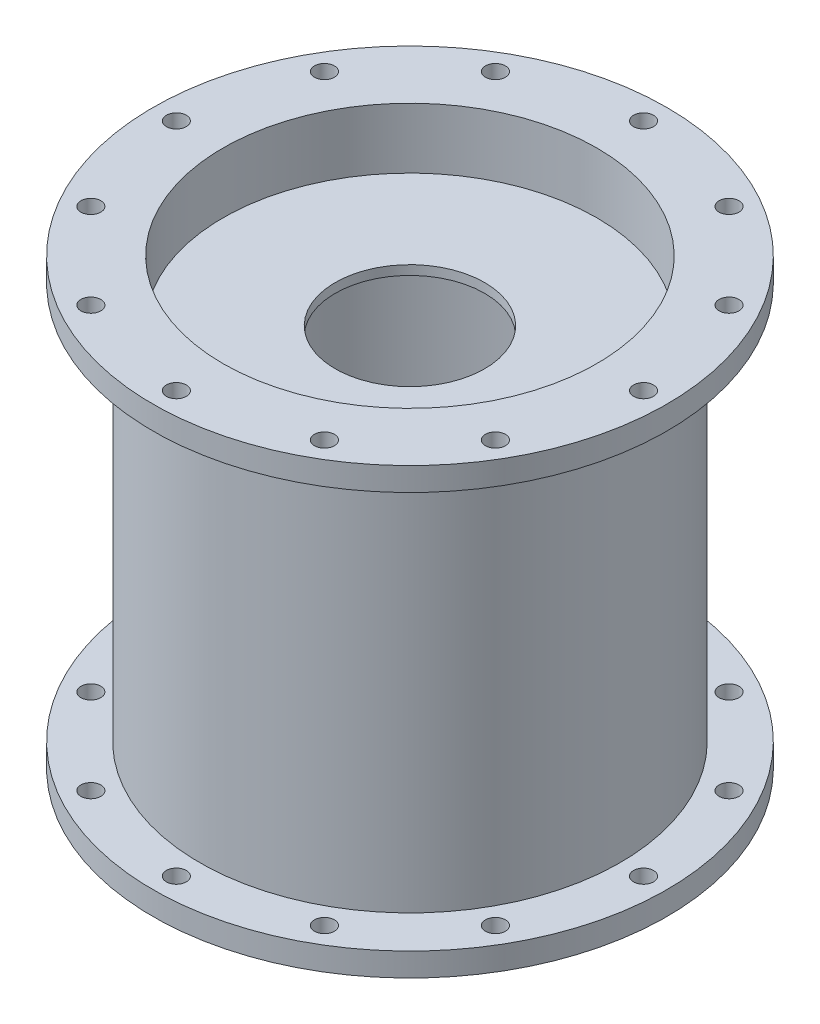
ISO-10303-21;
HEADER;
FILE_DESCRIPTION(('STEP AP214'),'2;1');
FILE_NAME('part.step','',(''),(''),'','','');
FILE_SCHEMA(('AUTOMOTIVE_DESIGN { 1 0 10303 214 1 1 1 1 }'));
ENDSEC;
DATA;
#1=APPLICATION_CONTEXT('core data for automotive mechanical design processes');
#2=APPLICATION_PROTOCOL_DEFINITION('international standard','automotive_design',2000,#1);
#3=PRODUCT_CONTEXT('',#1,'mechanical');
#4=PRODUCT('Part','Part','',(#3));
#5=PRODUCT_RELATED_PRODUCT_CATEGORY('part','',(#4));
#6=PRODUCT_DEFINITION_FORMATION('','',#4);
#7=PRODUCT_DEFINITION_CONTEXT('part definition',#1,'design');
#8=PRODUCT_DEFINITION('design','',#6,#7);
#9=PRODUCT_DEFINITION_SHAPE('','',#8);
#10=(LENGTH_UNIT() NAMED_UNIT(*) SI_UNIT(.MILLI.,.METRE.));
#11=(NAMED_UNIT(*) PLANE_ANGLE_UNIT() SI_UNIT($,.RADIAN.));
#12=(NAMED_UNIT(*) SI_UNIT($,.STERADIAN.) SOLID_ANGLE_UNIT());
#13=UNCERTAINTY_MEASURE_WITH_UNIT(LENGTH_MEASURE(1.E-05),#10,'distance_accuracy_value','');
#14=(GEOMETRIC_REPRESENTATION_CONTEXT(3) GLOBAL_UNCERTAINTY_ASSIGNED_CONTEXT((#13)) GLOBAL_UNIT_ASSIGNED_CONTEXT((#10,
#11,#12)) REPRESENTATION_CONTEXT('',''));
#15=CARTESIAN_POINT('',(0.,0.,0.));
#16=DIRECTION('',(0.,0.,1.));
#17=DIRECTION('',(1.,0.,0.));
#18=AXIS2_PLACEMENT_3D('',#15,#16,#17);
#19=CARTESIAN_POINT('',(0.,0.,-57.15));
#20=DIRECTION('',(0.,-1.,0.));
#21=DIRECTION('',(0.,0.,-1.));
#22=AXIS2_PLACEMENT_3D('',#19,#20,#21);
#23=PLANE('',#22);
#24=CARTESIAN_POINT('',(-54.9926131403119,0.,-31.75));
#25=DIRECTION('',(0.,1.,0.));
#26=DIRECTION('',(0.,0.,1.));
#27=AXIS2_PLACEMENT_3D('',#24,#25,#26);
#28=CIRCLE('',#27,2.70509999999997);
#29=CARTESIAN_POINT('',(-54.9926131403119,0.,-29.0449));
#30=VERTEX_POINT('',#29);
#31=EDGE_CURVE('E282',#30,#30,#28,.T.);
#32=ORIENTED_EDGE('',*,*,#31,.T.);
#33=EDGE_LOOP('',(#32));
#34=FACE_BOUND('',#33,.T.);
#35=CARTESIAN_POINT('',(-31.75,0.,-54.9926131403119));
#36=DIRECTION('',(0.,1.,0.));
#37=DIRECTION('',(0.,0.,1.));
#38=AXIS2_PLACEMENT_3D('',#35,#36,#37);
#39=CIRCLE('',#38,2.70509999999997);
#40=CARTESIAN_POINT('',(-31.75,0.,-52.2875131403119));
#41=VERTEX_POINT('',#40);
#42=EDGE_CURVE('E266',#41,#41,#39,.T.);
#43=ORIENTED_EDGE('',*,*,#42,.T.);
#44=EDGE_LOOP('',(#43));
#45=FACE_BOUND('',#44,.T.);
#46=CARTESIAN_POINT('',(31.75,0.,-54.9926131403119));
#47=DIRECTION('',(0.,1.,0.));
#48=DIRECTION('',(0.,0.,1.));
#49=AXIS2_PLACEMENT_3D('',#46,#47,#48);
#50=CIRCLE('',#49,2.70509999999997);
#51=CARTESIAN_POINT('',(31.75,0.,-52.2875131403119));
#52=VERTEX_POINT('',#51);
#53=EDGE_CURVE('E234',#52,#52,#50,.T.);
#54=ORIENTED_EDGE('',*,*,#53,.T.);
#55=EDGE_LOOP('',(#54));
#56=FACE_BOUND('',#55,.T.);
#57=CARTESIAN_POINT('',(54.9926131403118,0.,-31.75));
#58=DIRECTION('',(0.,1.,0.));
#59=DIRECTION('',(0.,0.,1.));
#60=AXIS2_PLACEMENT_3D('',#57,#58,#59);
#61=CIRCLE('',#60,2.70509999999997);
#62=CARTESIAN_POINT('',(54.9926131403118,0.,-29.0449));
#63=VERTEX_POINT('',#62);
#64=EDGE_CURVE('E218',#63,#63,#61,.T.);
#65=ORIENTED_EDGE('',*,*,#64,.T.);
#66=EDGE_LOOP('',(#65));
#67=FACE_BOUND('',#66,.T.);
#68=CARTESIAN_POINT('',(63.5,0.,0.));
#69=DIRECTION('',(0.,1.,0.));
#70=DIRECTION('',(0.,0.,1.));
#71=AXIS2_PLACEMENT_3D('',#68,#69,#70);
#72=CIRCLE('',#71,2.70509999999997);
#73=CARTESIAN_POINT('',(63.5,0.,2.70509999999998));
#74=VERTEX_POINT('',#73);
#75=EDGE_CURVE('E202',#74,#74,#72,.T.);
#76=ORIENTED_EDGE('',*,*,#75,.T.);
#77=EDGE_LOOP('',(#76));
#78=FACE_BOUND('',#77,.T.);
#79=CARTESIAN_POINT('',(54.9926131403119,0.,31.75));
#80=DIRECTION('',(0.,1.,0.));
#81=DIRECTION('',(0.,0.,1.));
#82=AXIS2_PLACEMENT_3D('',#79,#80,#81);
#83=CIRCLE('',#82,2.70509999999997);
#84=CARTESIAN_POINT('',(54.9926131403119,0.,34.4551));
#85=VERTEX_POINT('',#84);
#86=EDGE_CURVE('E186',#85,#85,#83,.T.);
#87=ORIENTED_EDGE('',*,*,#86,.T.);
#88=EDGE_LOOP('',(#87));
#89=FACE_BOUND('',#88,.T.);
#90=CARTESIAN_POINT('',(31.75,0.,54.9926131403118));
#91=DIRECTION('',(0.,1.,0.));
#92=DIRECTION('',(0.,0.,1.));
#93=AXIS2_PLACEMENT_3D('',#90,#91,#92);
#94=CIRCLE('',#93,2.70509999999997);
#95=CARTESIAN_POINT('',(31.75,0.,57.6977131403118));
#96=VERTEX_POINT('',#95);
#97=EDGE_CURVE('E170',#96,#96,#94,.T.);
#98=ORIENTED_EDGE('',*,*,#97,.T.);
#99=EDGE_LOOP('',(#98));
#100=FACE_BOUND('',#99,.T.);
#101=CARTESIAN_POINT('',(0.,0.,63.5));
#102=DIRECTION('',(0.,1.,0.));
#103=DIRECTION('',(0.,0.,1.));
#104=AXIS2_PLACEMENT_3D('',#101,#102,#103);
#105=CIRCLE('',#104,2.70509999999997);
#106=CARTESIAN_POINT('',(0.,0.,66.2051));
#107=VERTEX_POINT('',#106);
#108=EDGE_CURVE('E154',#107,#107,#105,.T.);
#109=ORIENTED_EDGE('',*,*,#108,.T.);
#110=EDGE_LOOP('',(#109));
#111=FACE_BOUND('',#110,.T.);
#112=CARTESIAN_POINT('',(-31.75,0.,54.9926131403119));
#113=DIRECTION('',(0.,1.,0.));
#114=DIRECTION('',(0.,0.,1.));
#115=AXIS2_PLACEMENT_3D('',#112,#113,#114);
#116=CIRCLE('',#115,2.70509999999997);
#117=CARTESIAN_POINT('',(-31.75,0.,57.6977131403118));
#118=VERTEX_POINT('',#117);
#119=EDGE_CURVE('E138',#118,#118,#116,.T.);
#120=ORIENTED_EDGE('',*,*,#119,.T.);
#121=EDGE_LOOP('',(#120));
#122=FACE_BOUND('',#121,.T.);
#123=CARTESIAN_POINT('',(-54.9926131403119,0.,31.75));
#124=DIRECTION('',(0.,1.,0.));
#125=DIRECTION('',(0.,0.,1.));
#126=AXIS2_PLACEMENT_3D('',#123,#124,#125);
#127=CIRCLE('',#126,2.70509999999997);
#128=CARTESIAN_POINT('',(-54.9926131403119,0.,34.4551));
#129=VERTEX_POINT('',#128);
#130=EDGE_CURVE('E122',#129,#129,#127,.T.);
#131=ORIENTED_EDGE('',*,*,#130,.T.);
#132=EDGE_LOOP('',(#131));
#133=FACE_BOUND('',#132,.T.);
#134=CARTESIAN_POINT('',(0.,0.,0.));
#135=DIRECTION('',(0.,-1.,0.));
#136=DIRECTION('',(0.,0.,-1.));
#137=AXIS2_PLACEMENT_3D('',#134,#135,#136);
#138=CIRCLE('',#137,69.85);
#139=CARTESIAN_POINT('',(0.,0.,-69.85));
#140=VERTEX_POINT('',#139);
#141=EDGE_CURVE('E66',#140,#140,#138,.T.);
#142=ORIENTED_EDGE('',*,*,#141,.T.);
#143=EDGE_LOOP('',(#142));
#144=FACE_BOUND('',#143,.T.);
#145=CARTESIAN_POINT('',(0.,0.,0.));
#146=DIRECTION('',(0.,-1.,0.));
#147=DIRECTION('',(0.,0.,-1.));
#148=AXIS2_PLACEMENT_3D('',#145,#146,#147);
#149=CIRCLE('',#148,50.8);
#150=CARTESIAN_POINT('',(0.,0.,-50.8));
#151=VERTEX_POINT('',#150);
#152=EDGE_CURVE('E94',#151,#151,#149,.T.);
#153=ORIENTED_EDGE('',*,*,#152,.F.);
#154=EDGE_LOOP('',(#153));
#155=FACE_BOUND('',#154,.T.);
#156=CARTESIAN_POINT('',(0.,0.,-63.5));
#157=DIRECTION('',(0.,1.,0.));
#158=DIRECTION('',(0.,0.,1.));
#159=AXIS2_PLACEMENT_3D('',#156,#157,#158);
#160=CIRCLE('',#159,2.70509999999997);
#161=CARTESIAN_POINT('',(0.,0.,-60.7949));
#162=VERTEX_POINT('',#161);
#163=EDGE_CURVE('E250',#162,#162,#160,.T.);
#164=ORIENTED_EDGE('',*,*,#163,.T.);
#165=EDGE_LOOP('',(#164));
#166=FACE_BOUND('',#165,.T.);
#167=CARTESIAN_POINT('',(-63.5,0.,0.));
#168=DIRECTION('',(0.,1.,0.));
#169=DIRECTION('',(0.,0.,1.));
#170=AXIS2_PLACEMENT_3D('',#167,#168,#169);
#171=CIRCLE('',#170,2.70509999999997);
#172=CARTESIAN_POINT('',(-63.5,0.,2.70509999999996));
#173=VERTEX_POINT('',#172);
#174=EDGE_CURVE('E298',#173,#173,#171,.T.);
#175=ORIENTED_EDGE('',*,*,#174,.T.);
#176=EDGE_LOOP('',(#175));
#177=FACE_BOUND('',#176,.T.);
#178=ADVANCED_FACE('F43',(#34,#45,#56,#67,#78,#89,#100,#111,#122,#133,#144,#155,#166,#177),#23,.T.);
#179=CARTESIAN_POINT('',(0.,0.,0.));
#180=DIRECTION('',(0.,-1.,0.));
#181=DIRECTION('',(0.,0.,-1.));
#182=AXIS2_PLACEMENT_3D('',#179,#180,#181);
#183=CYLINDRICAL_SURFACE('',#182,50.8);
#184=CARTESIAN_POINT('',(0.,101.661657822041,0.));
#185=DIRECTION('',(0.,-1.,0.));
#186=DIRECTION('',(0.,0.,-1.));
#187=AXIS2_PLACEMENT_3D('',#184,#185,#186);
#188=CIRCLE('',#187,50.8);
#189=CARTESIAN_POINT('',(0.,101.661657822041,-50.8));
#190=VERTEX_POINT('',#189);
#191=EDGE_CURVE('E10',#190,#190,#188,.T.);
#192=ORIENTED_EDGE('',*,*,#191,.F.);
#193=EDGE_LOOP('',(#192));
#194=FACE_BOUND('',#193,.T.);
#195=CARTESIAN_POINT('',(0.,18.9883421779588,0.));
#196=DIRECTION('',(0.,1.,0.));
#197=DIRECTION('',(0.,0.,1.));
#198=AXIS2_PLACEMENT_3D('',#195,#196,#197);
#199=CIRCLE('',#198,50.8);
#200=CARTESIAN_POINT('',(0.,18.9883421779588,50.8));
#201=VERTEX_POINT('',#200);
#202=EDGE_CURVE('E55',#201,#201,#199,.T.);
#203=ORIENTED_EDGE('',*,*,#202,.F.);
#204=EDGE_LOOP('',(#203));
#205=FACE_BOUND('',#204,.T.);
#206=ADVANCED_FACE('F374',(#194,#205),#183,.F.);
#207=CARTESIAN_POINT('',(0.,104.201657822041,0.));
#208=DIRECTION('',(0.,1.,0.));
#209=DIRECTION('',(0.,0.,1.));
#210=AXIS2_PLACEMENT_3D('',#207,#208,#209);
#211=CIRCLE('',#210,50.8);
#212=CARTESIAN_POINT('',(0.,104.201657822041,50.8));
#213=VERTEX_POINT('',#212);
#214=EDGE_CURVE('E50',#213,#213,#211,.T.);
#215=ORIENTED_EDGE('',*,*,#214,.F.);
#216=EDGE_LOOP('',(#215));
#217=FACE_BOUND('',#216,.T.);
#218=CARTESIAN_POINT('',(0.,120.65,0.));
#219=DIRECTION('',(0.,-1.,0.));
#220=DIRECTION('',(0.,0.,-1.));
#221=AXIS2_PLACEMENT_3D('',#218,#219,#220);
#222=CIRCLE('',#221,50.8);
#223=CARTESIAN_POINT('',(0.,120.65,-50.8));
#224=VERTEX_POINT('',#223);
#225=EDGE_CURVE('E90',#224,#224,#222,.T.);
#226=ORIENTED_EDGE('',*,*,#225,.F.);
#227=EDGE_LOOP('',(#226));
#228=FACE_BOUND('',#227,.T.);
#229=ADVANCED_FACE('F369',(#217,#228),#183,.F.);
#230=CARTESIAN_POINT('',(0.,0.,0.));
#231=DIRECTION('',(0.,-1.,0.));
#232=DIRECTION('',(0.,0.,-1.));
#233=AXIS2_PLACEMENT_3D('',#230,#231,#232);
#234=CYLINDRICAL_SURFACE('',#233,69.85);
#235=CARTESIAN_POINT('',(0.,6.35,0.));
#236=DIRECTION('',(0.,-1.,0.));
#237=DIRECTION('',(0.,0.,-1.));
#238=AXIS2_PLACEMENT_3D('',#235,#236,#237);
#239=CIRCLE('',#238,69.85);
#240=CARTESIAN_POINT('',(0.,6.35,-69.85));
#241=VERTEX_POINT('',#240);
#242=EDGE_CURVE('E70',#241,#241,#239,.T.);
#243=ORIENTED_EDGE('',*,*,#242,.T.);
#244=EDGE_LOOP('',(#243));
#245=FACE_BOUND('',#244,.T.);
#246=ORIENTED_EDGE('',*,*,#141,.F.);
#247=EDGE_LOOP('',(#246));
#248=FACE_BOUND('',#247,.T.);
#249=ADVANCED_FACE('F362',(#245,#248),#234,.T.);
#250=CARTESIAN_POINT('',(0.,6.35,-69.85));
#251=DIRECTION('',(0.,1.,0.));
#252=DIRECTION('',(0.,0.,1.));
#253=AXIS2_PLACEMENT_3D('',#250,#251,#252);
#254=PLANE('',#253);
#255=CARTESIAN_POINT('',(-63.5,6.34999999999999,0.));
#256=DIRECTION('',(0.,1.,0.));
#257=DIRECTION('',(0.,0.,1.));
#258=AXIS2_PLACEMENT_3D('',#255,#256,#257);
#259=CIRCLE('',#258,2.70509999999998);
#260=CARTESIAN_POINT('',(-63.5,6.34999999999999,2.70509999999997));
#261=VERTEX_POINT('',#260);
#262=EDGE_CURVE('E290',#261,#261,#259,.T.);
#263=ORIENTED_EDGE('',*,*,#262,.F.);
#264=EDGE_LOOP('',(#263));
#265=FACE_BOUND('',#264,.T.);
#266=CARTESIAN_POINT('',(-54.9926131403119,6.34999999999999,-31.75));
#267=DIRECTION('',(0.,1.,0.));
#268=DIRECTION('',(0.,0.,1.));
#269=AXIS2_PLACEMENT_3D('',#266,#267,#268);
#270=CIRCLE('',#269,2.70509999999998);
#271=CARTESIAN_POINT('',(-54.9926131403119,6.34999999999999,-29.0449));
#272=VERTEX_POINT('',#271);
#273=EDGE_CURVE('E274',#272,#272,#270,.T.);
#274=ORIENTED_EDGE('',*,*,#273,.F.);
#275=EDGE_LOOP('',(#274));
#276=FACE_BOUND('',#275,.T.);
#277=CARTESIAN_POINT('',(-31.75,6.34999999999999,-54.9926131403119));
#278=DIRECTION('',(0.,1.,0.));
#279=DIRECTION('',(0.,0.,1.));
#280=AXIS2_PLACEMENT_3D('',#277,#278,#279);
#281=CIRCLE('',#280,2.70509999999998);
#282=CARTESIAN_POINT('',(-31.75,6.34999999999999,-52.2875131403119));
#283=VERTEX_POINT('',#282);
#284=EDGE_CURVE('E258',#283,#283,#281,.T.);
#285=ORIENTED_EDGE('',*,*,#284,.F.);
#286=EDGE_LOOP('',(#285));
#287=FACE_BOUND('',#286,.T.);
#288=CARTESIAN_POINT('',(0.,6.34999999999999,-63.5));
#289=DIRECTION('',(0.,1.,0.));
#290=DIRECTION('',(0.,0.,1.));
#291=AXIS2_PLACEMENT_3D('',#288,#289,#290);
#292=CIRCLE('',#291,2.70509999999998);
#293=CARTESIAN_POINT('',(0.,6.34999999999999,-60.7949));
#294=VERTEX_POINT('',#293);
#295=EDGE_CURVE('E242',#294,#294,#292,.T.);
#296=ORIENTED_EDGE('',*,*,#295,.F.);
#297=EDGE_LOOP('',(#296));
#298=FACE_BOUND('',#297,.T.);
#299=CARTESIAN_POINT('',(31.75,6.34999999999999,-54.9926131403119));
#300=DIRECTION('',(0.,1.,0.));
#301=DIRECTION('',(0.,0.,1.));
#302=AXIS2_PLACEMENT_3D('',#299,#300,#301);
#303=CIRCLE('',#302,2.70509999999998);
#304=CARTESIAN_POINT('',(31.75,6.34999999999999,-52.2875131403119));
#305=VERTEX_POINT('',#304);
#306=EDGE_CURVE('E226',#305,#305,#303,.T.);
#307=ORIENTED_EDGE('',*,*,#306,.F.);
#308=EDGE_LOOP('',(#307));
#309=FACE_BOUND('',#308,.T.);
#310=CARTESIAN_POINT('',(54.9926131403118,6.34999999999999,-31.75));
#311=DIRECTION('',(0.,1.,0.));
#312=DIRECTION('',(0.,0.,1.));
#313=AXIS2_PLACEMENT_3D('',#310,#311,#312);
#314=CIRCLE('',#313,2.70509999999998);
#315=CARTESIAN_POINT('',(54.9926131403118,6.34999999999999,-29.0449));
#316=VERTEX_POINT('',#315);
#317=EDGE_CURVE('E210',#316,#316,#314,.T.);
#318=ORIENTED_EDGE('',*,*,#317,.F.);
#319=EDGE_LOOP('',(#318));
#320=FACE_BOUND('',#319,.T.);
#321=CARTESIAN_POINT('',(63.5,6.34999999999999,0.));
#322=DIRECTION('',(0.,1.,0.));
#323=DIRECTION('',(0.,0.,1.));
#324=AXIS2_PLACEMENT_3D('',#321,#322,#323);
#325=CIRCLE('',#324,2.70509999999998);
#326=CARTESIAN_POINT('',(63.5,6.34999999999999,2.70509999999998));
#327=VERTEX_POINT('',#326);
#328=EDGE_CURVE('E194',#327,#327,#325,.T.);
#329=ORIENTED_EDGE('',*,*,#328,.F.);
#330=EDGE_LOOP('',(#329));
#331=FACE_BOUND('',#330,.T.);
#332=CARTESIAN_POINT('',(54.9926131403119,6.34999999999999,31.75));
#333=DIRECTION('',(0.,1.,0.));
#334=DIRECTION('',(0.,0.,1.));
#335=AXIS2_PLACEMENT_3D('',#332,#333,#334);
#336=CIRCLE('',#335,2.70509999999998);
#337=CARTESIAN_POINT('',(54.9926131403119,6.34999999999999,34.4551));
#338=VERTEX_POINT('',#337);
#339=EDGE_CURVE('E178',#338,#338,#336,.T.);
#340=ORIENTED_EDGE('',*,*,#339,.F.);
#341=EDGE_LOOP('',(#340));
#342=FACE_BOUND('',#341,.T.);
#343=CARTESIAN_POINT('',(31.75,6.34999999999999,54.9926131403118));
#344=DIRECTION('',(0.,1.,0.));
#345=DIRECTION('',(0.,0.,1.));
#346=AXIS2_PLACEMENT_3D('',#343,#344,#345);
#347=CIRCLE('',#346,2.70509999999998);
#348=CARTESIAN_POINT('',(31.75,6.34999999999999,57.6977131403118));
#349=VERTEX_POINT('',#348);
#350=EDGE_CURVE('E162',#349,#349,#347,.T.);
#351=ORIENTED_EDGE('',*,*,#350,.F.);
#352=EDGE_LOOP('',(#351));
#353=FACE_BOUND('',#352,.T.);
#354=CARTESIAN_POINT('',(0.,6.34999999999999,63.5));
#355=DIRECTION('',(0.,1.,0.));
#356=DIRECTION('',(0.,0.,1.));
#357=AXIS2_PLACEMENT_3D('',#354,#355,#356);
#358=CIRCLE('',#357,2.70509999999998);
#359=CARTESIAN_POINT('',(0.,6.34999999999999,66.2051));
#360=VERTEX_POINT('',#359);
#361=EDGE_CURVE('E146',#360,#360,#358,.T.);
#362=ORIENTED_EDGE('',*,*,#361,.F.);
#363=EDGE_LOOP('',(#362));
#364=FACE_BOUND('',#363,.T.);
#365=CARTESIAN_POINT('',(-31.75,6.34999999999999,54.9926131403119));
#366=DIRECTION('',(0.,1.,0.));
#367=DIRECTION('',(0.,0.,1.));
#368=AXIS2_PLACEMENT_3D('',#365,#366,#367);
#369=CIRCLE('',#368,2.70509999999998);
#370=CARTESIAN_POINT('',(-31.75,6.34999999999999,57.6977131403119));
#371=VERTEX_POINT('',#370);
#372=EDGE_CURVE('E130',#371,#371,#369,.T.);
#373=ORIENTED_EDGE('',*,*,#372,.F.);
#374=EDGE_LOOP('',(#373));
#375=FACE_BOUND('',#374,.T.);
#376=CARTESIAN_POINT('',(-54.9926131403119,6.34999999999999,31.75));
#377=DIRECTION('',(0.,1.,0.));
#378=DIRECTION('',(0.,0.,1.));
#379=AXIS2_PLACEMENT_3D('',#376,#377,#378);
#380=CIRCLE('',#379,2.70509999999998);
#381=CARTESIAN_POINT('',(-54.9926131403119,6.34999999999999,34.4551));
#382=VERTEX_POINT('',#381);
#383=EDGE_CURVE('E114',#382,#382,#380,.T.);
#384=ORIENTED_EDGE('',*,*,#383,.F.);
#385=EDGE_LOOP('',(#384));
#386=FACE_BOUND('',#385,.T.);
#387=CARTESIAN_POINT('',(0.,6.35,0.));
#388=DIRECTION('',(0.,-1.,0.));
#389=DIRECTION('',(0.,0.,-1.));
#390=AXIS2_PLACEMENT_3D('',#387,#388,#389);
#391=CIRCLE('',#390,57.15);
#392=CARTESIAN_POINT('',(0.,6.35,-57.15));
#393=VERTEX_POINT('',#392);
#394=EDGE_CURVE('E74',#393,#393,#391,.T.);
#395=ORIENTED_EDGE('',*,*,#394,.T.);
#396=EDGE_LOOP('',(#395));
#397=FACE_BOUND('',#396,.T.);
#398=ORIENTED_EDGE('',*,*,#242,.F.);
#399=EDGE_LOOP('',(#398));
#400=FACE_BOUND('',#399,.T.);
#401=ADVANCED_FACE('F356',(#265,#276,#287,#298,#309,#320,#331,#342,#353,#364,#375,#386,#397,
#400),#254,.T.);
#402=CARTESIAN_POINT('',(0.,0.,0.));
#403=DIRECTION('',(0.,-1.,0.));
#404=DIRECTION('',(0.,0.,-1.));
#405=AXIS2_PLACEMENT_3D('',#402,#403,#404);
#406=CYLINDRICAL_SURFACE('',#405,57.15);
#407=CARTESIAN_POINT('',(0.,114.3,0.));
#408=DIRECTION('',(0.,-1.,0.));
#409=DIRECTION('',(0.,0.,-1.));
#410=AXIS2_PLACEMENT_3D('',#407,#408,#409);
#411=CIRCLE('',#410,57.15);
#412=CARTESIAN_POINT('',(0.,114.3,-57.15));
#413=VERTEX_POINT('',#412);
#414=EDGE_CURVE('E78',#413,#413,#411,.T.);
#415=ORIENTED_EDGE('',*,*,#414,.T.);
#416=EDGE_LOOP('',(#415));
#417=FACE_BOUND('',#416,.T.);
#418=ORIENTED_EDGE('',*,*,#394,.F.);
#419=EDGE_LOOP('',(#418));
#420=FACE_BOUND('',#419,.T.);
#421=ADVANCED_FACE('F349',(#417,#420),#406,.T.);
#422=CARTESIAN_POINT('',(0.,114.3,-69.85));
#423=DIRECTION('',(0.,-1.,0.));
#424=DIRECTION('',(0.,0.,-1.));
#425=AXIS2_PLACEMENT_3D('',#422,#423,#424);
#426=PLANE('',#425);
#427=CARTESIAN_POINT('',(-63.5,114.3,0.));
#428=DIRECTION('',(0.,-1.,0.));
#429=DIRECTION('',(0.,0.,-1.));
#430=AXIS2_PLACEMENT_3D('',#427,#428,#429);
#431=CIRCLE('',#430,2.70509999999998);
#432=CARTESIAN_POINT('',(-63.5,114.3,-2.70509999999999));
#433=VERTEX_POINT('',#432);
#434=EDGE_CURVE('E294',#433,#433,#431,.T.);
#435=ORIENTED_EDGE('',*,*,#434,.F.);
#436=EDGE_LOOP('',(#435));
#437=FACE_BOUND('',#436,.T.);
#438=CARTESIAN_POINT('',(-54.9926131403119,114.3,-31.75));
#439=DIRECTION('',(0.,-1.,0.));
#440=DIRECTION('',(0.,0.,-1.));
#441=AXIS2_PLACEMENT_3D('',#438,#439,#440);
#442=CIRCLE('',#441,2.70509999999998);
#443=CARTESIAN_POINT('',(-54.9926131403119,114.3,-34.4551));
#444=VERTEX_POINT('',#443);
#445=EDGE_CURVE('E278',#444,#444,#442,.T.);
#446=ORIENTED_EDGE('',*,*,#445,.F.);
#447=EDGE_LOOP('',(#446));
#448=FACE_BOUND('',#447,.T.);
#449=CARTESIAN_POINT('',(-31.75,114.3,-54.9926131403119));
#450=DIRECTION('',(0.,-1.,0.));
#451=DIRECTION('',(0.,0.,-1.));
#452=AXIS2_PLACEMENT_3D('',#449,#450,#451);
#453=CIRCLE('',#452,2.70509999999998);
#454=CARTESIAN_POINT('',(-31.75,114.3,-57.6977131403118));
#455=VERTEX_POINT('',#454);
#456=EDGE_CURVE('E262',#455,#455,#453,.T.);
#457=ORIENTED_EDGE('',*,*,#456,.F.);
#458=EDGE_LOOP('',(#457));
#459=FACE_BOUND('',#458,.T.);
#460=CARTESIAN_POINT('',(0.,114.3,-63.5));
#461=DIRECTION('',(0.,-1.,0.));
#462=DIRECTION('',(0.,0.,-1.));
#463=AXIS2_PLACEMENT_3D('',#460,#461,#462);
#464=CIRCLE('',#463,2.70509999999998);
#465=CARTESIAN_POINT('',(0.,114.3,-66.2051));
#466=VERTEX_POINT('',#465);
#467=EDGE_CURVE('E246',#466,#466,#464,.T.);
#468=ORIENTED_EDGE('',*,*,#467,.F.);
#469=EDGE_LOOP('',(#468));
#470=FACE_BOUND('',#469,.T.);
#471=CARTESIAN_POINT('',(31.75,114.3,-54.9926131403119));
#472=DIRECTION('',(0.,-1.,0.));
#473=DIRECTION('',(0.,0.,-1.));
#474=AXIS2_PLACEMENT_3D('',#471,#472,#473);
#475=CIRCLE('',#474,2.70509999999998);
#476=CARTESIAN_POINT('',(31.75,114.3,-57.6977131403118));
#477=VERTEX_POINT('',#476);
#478=EDGE_CURVE('E230',#477,#477,#475,.T.);
#479=ORIENTED_EDGE('',*,*,#478,.F.);
#480=EDGE_LOOP('',(#479));
#481=FACE_BOUND('',#480,.T.);
#482=CARTESIAN_POINT('',(54.9926131403118,114.3,-31.75));
#483=DIRECTION('',(0.,-1.,0.));
#484=DIRECTION('',(0.,0.,-1.));
#485=AXIS2_PLACEMENT_3D('',#482,#483,#484);
#486=CIRCLE('',#485,2.70509999999998);
#487=CARTESIAN_POINT('',(54.9926131403118,114.3,-34.4551));
#488=VERTEX_POINT('',#487);
#489=EDGE_CURVE('E214',#488,#488,#486,.T.);
#490=ORIENTED_EDGE('',*,*,#489,.F.);
#491=EDGE_LOOP('',(#490));
#492=FACE_BOUND('',#491,.T.);
#493=CARTESIAN_POINT('',(63.5,114.3,0.));
#494=DIRECTION('',(0.,-1.,0.));
#495=DIRECTION('',(0.,0.,-1.));
#496=AXIS2_PLACEMENT_3D('',#493,#494,#495);
#497=CIRCLE('',#496,2.70509999999998);
#498=CARTESIAN_POINT('',(63.5,114.3,-2.70509999999998));
#499=VERTEX_POINT('',#498);
#500=EDGE_CURVE('E198',#499,#499,#497,.T.);
#501=ORIENTED_EDGE('',*,*,#500,.F.);
#502=EDGE_LOOP('',(#501));
#503=FACE_BOUND('',#502,.T.);
#504=CARTESIAN_POINT('',(54.9926131403119,114.3,31.75));
#505=DIRECTION('',(0.,-1.,0.));
#506=DIRECTION('',(0.,0.,-1.));
#507=AXIS2_PLACEMENT_3D('',#504,#505,#506);
#508=CIRCLE('',#507,2.70509999999998);
#509=CARTESIAN_POINT('',(54.9926131403119,114.3,29.0449));
#510=VERTEX_POINT('',#509);
#511=EDGE_CURVE('E182',#510,#510,#508,.T.);
#512=ORIENTED_EDGE('',*,*,#511,.F.);
#513=EDGE_LOOP('',(#512));
#514=FACE_BOUND('',#513,.T.);
#515=CARTESIAN_POINT('',(31.75,114.3,54.9926131403118));
#516=DIRECTION('',(0.,-1.,0.));
#517=DIRECTION('',(0.,0.,-1.));
#518=AXIS2_PLACEMENT_3D('',#515,#516,#517);
#519=CIRCLE('',#518,2.70509999999998);
#520=CARTESIAN_POINT('',(31.75,114.3,52.2875131403119));
#521=VERTEX_POINT('',#520);
#522=EDGE_CURVE('E166',#521,#521,#519,.T.);
#523=ORIENTED_EDGE('',*,*,#522,.F.);
#524=EDGE_LOOP('',(#523));
#525=FACE_BOUND('',#524,.T.);
#526=CARTESIAN_POINT('',(0.,114.3,63.5));
#527=DIRECTION('',(0.,-1.,0.));
#528=DIRECTION('',(0.,0.,-1.));
#529=AXIS2_PLACEMENT_3D('',#526,#527,#528);
#530=CIRCLE('',#529,2.70509999999998);
#531=CARTESIAN_POINT('',(0.,114.3,60.7949));
#532=VERTEX_POINT('',#531);
#533=EDGE_CURVE('E150',#532,#532,#530,.T.);
#534=ORIENTED_EDGE('',*,*,#533,.F.);
#535=EDGE_LOOP('',(#534));
#536=FACE_BOUND('',#535,.T.);
#537=CARTESIAN_POINT('',(-31.75,114.3,54.9926131403119));
#538=DIRECTION('',(0.,-1.,0.));
#539=DIRECTION('',(0.,0.,-1.));
#540=AXIS2_PLACEMENT_3D('',#537,#538,#539);
#541=CIRCLE('',#540,2.70509999999998);
#542=CARTESIAN_POINT('',(-31.75,114.3,52.2875131403119));
#543=VERTEX_POINT('',#542);
#544=EDGE_CURVE('E134',#543,#543,#541,.T.);
#545=ORIENTED_EDGE('',*,*,#544,.F.);
#546=EDGE_LOOP('',(#545));
#547=FACE_BOUND('',#546,.T.);
#548=CARTESIAN_POINT('',(-54.9926131403119,114.3,31.75));
#549=DIRECTION('',(0.,-1.,0.));
#550=DIRECTION('',(0.,0.,-1.));
#551=AXIS2_PLACEMENT_3D('',#548,#549,#550);
#552=CIRCLE('',#551,2.70509999999998);
#553=CARTESIAN_POINT('',(-54.9926131403119,114.3,29.0449));
#554=VERTEX_POINT('',#553);
#555=EDGE_CURVE('E118',#554,#554,#552,.T.);
#556=ORIENTED_EDGE('',*,*,#555,.F.);
#557=EDGE_LOOP('',(#556));
#558=FACE_BOUND('',#557,.T.);
#559=CARTESIAN_POINT('',(0.,114.3,0.));
#560=DIRECTION('',(0.,-1.,0.));
#561=DIRECTION('',(0.,0.,-1.));
#562=AXIS2_PLACEMENT_3D('',#559,#560,#561);
#563=CIRCLE('',#562,69.85);
#564=CARTESIAN_POINT('',(0.,114.3,-69.85));
#565=VERTEX_POINT('',#564);
#566=EDGE_CURVE('E82',#565,#565,#563,.T.);
#567=ORIENTED_EDGE('',*,*,#566,.T.);
#568=EDGE_LOOP('',(#567));
#569=FACE_BOUND('',#568,.T.);
#570=ORIENTED_EDGE('',*,*,#414,.F.);
#571=EDGE_LOOP('',(#570));
#572=FACE_BOUND('',#571,.T.);
#573=ADVANCED_FACE('F343',(#437,#448,#459,#470,#481,#492,#503,#514,#525,#536,#547,#558,#569,
#572),#426,.T.);
#574=CARTESIAN_POINT('',(0.,0.,0.));
#575=DIRECTION('',(0.,-1.,0.));
#576=DIRECTION('',(0.,0.,-1.));
#577=AXIS2_PLACEMENT_3D('',#574,#575,#576);
#578=CYLINDRICAL_SURFACE('',#577,69.85);
#579=CARTESIAN_POINT('',(0.,120.65,0.));
#580=DIRECTION('',(0.,-1.,0.));
#581=DIRECTION('',(0.,0.,-1.));
#582=AXIS2_PLACEMENT_3D('',#579,#580,#581);
#583=CIRCLE('',#582,69.85);
#584=CARTESIAN_POINT('',(0.,120.65,-69.85));
#585=VERTEX_POINT('',#584);
#586=EDGE_CURVE('E86',#585,#585,#583,.T.);
#587=ORIENTED_EDGE('',*,*,#586,.T.);
#588=EDGE_LOOP('',(#587));
#589=FACE_BOUND('',#588,.T.);
#590=ORIENTED_EDGE('',*,*,#566,.F.);
#591=EDGE_LOOP('',(#590));
#592=FACE_BOUND('',#591,.T.);
#593=ADVANCED_FACE('F313',(#589,#592),#578,.T.);
#594=CARTESIAN_POINT('',(0.,120.65,-50.8));
#595=DIRECTION('',(0.,1.,0.));
#596=DIRECTION('',(0.,0.,1.));
#597=AXIS2_PLACEMENT_3D('',#594,#595,#596);
#598=PLANE('',#597);
#599=CARTESIAN_POINT('',(-63.5,120.65,0.));
#600=DIRECTION('',(0.,1.,0.));
#601=DIRECTION('',(0.,0.,1.));
#602=AXIS2_PLACEMENT_3D('',#599,#600,#601);
#603=CIRCLE('',#602,2.70509999999999);
#604=CARTESIAN_POINT('',(-63.5,120.65,2.70509999999998));
#605=VERTEX_POINT('',#604);
#606=EDGE_CURVE('E302',#605,#605,#603,.T.);
#607=ORIENTED_EDGE('',*,*,#606,.F.);
#608=EDGE_LOOP('',(#607));
#609=FACE_BOUND('',#608,.T.);
#610=CARTESIAN_POINT('',(-54.9926131403119,120.65,-31.75));
#611=DIRECTION('',(0.,1.,0.));
#612=DIRECTION('',(0.,0.,1.));
#613=AXIS2_PLACEMENT_3D('',#610,#611,#612);
#614=CIRCLE('',#613,2.70509999999999);
#615=CARTESIAN_POINT('',(-54.9926131403119,120.65,-29.0449));
#616=VERTEX_POINT('',#615);
#617=EDGE_CURVE('E286',#616,#616,#614,.T.);
#618=ORIENTED_EDGE('',*,*,#617,.F.);
#619=EDGE_LOOP('',(#618));
#620=FACE_BOUND('',#619,.T.);
#621=CARTESIAN_POINT('',(-31.75,120.65,-54.9926131403119));
#622=DIRECTION('',(0.,1.,0.));
#623=DIRECTION('',(0.,0.,1.));
#624=AXIS2_PLACEMENT_3D('',#621,#622,#623);
#625=CIRCLE('',#624,2.70509999999999);
#626=CARTESIAN_POINT('',(-31.75,120.65,-52.2875131403119));
#627=VERTEX_POINT('',#626);
#628=EDGE_CURVE('E270',#627,#627,#625,.T.);
#629=ORIENTED_EDGE('',*,*,#628,.F.);
#630=EDGE_LOOP('',(#629));
#631=FACE_BOUND('',#630,.T.);
#632=CARTESIAN_POINT('',(0.,120.65,-63.5));
#633=DIRECTION('',(0.,1.,0.));
#634=DIRECTION('',(0.,0.,1.));
#635=AXIS2_PLACEMENT_3D('',#632,#633,#634);
#636=CIRCLE('',#635,2.70509999999999);
#637=CARTESIAN_POINT('',(0.,120.65,-60.7949));
#638=VERTEX_POINT('',#637);
#639=EDGE_CURVE('E254',#638,#638,#636,.T.);
#640=ORIENTED_EDGE('',*,*,#639,.F.);
#641=EDGE_LOOP('',(#640));
#642=FACE_BOUND('',#641,.T.);
#643=CARTESIAN_POINT('',(31.75,120.65,-54.9926131403119));
#644=DIRECTION('',(0.,1.,0.));
#645=DIRECTION('',(0.,0.,1.));
#646=AXIS2_PLACEMENT_3D('',#643,#644,#645);
#647=CIRCLE('',#646,2.70509999999999);
#648=CARTESIAN_POINT('',(31.75,120.65,-52.2875131403119));
#649=VERTEX_POINT('',#648);
#650=EDGE_CURVE('E238',#649,#649,#647,.T.);
#651=ORIENTED_EDGE('',*,*,#650,.F.);
#652=EDGE_LOOP('',(#651));
#653=FACE_BOUND('',#652,.T.);
#654=CARTESIAN_POINT('',(54.9926131403118,120.65,-31.75));
#655=DIRECTION('',(0.,1.,0.));
#656=DIRECTION('',(0.,0.,1.));
#657=AXIS2_PLACEMENT_3D('',#654,#655,#656);
#658=CIRCLE('',#657,2.70509999999999);
#659=CARTESIAN_POINT('',(54.9926131403118,120.65,-29.0449));
#660=VERTEX_POINT('',#659);
#661=EDGE_CURVE('E222',#660,#660,#658,.T.);
#662=ORIENTED_EDGE('',*,*,#661,.F.);
#663=EDGE_LOOP('',(#662));
#664=FACE_BOUND('',#663,.T.);
#665=CARTESIAN_POINT('',(63.5,120.65,0.));
#666=DIRECTION('',(0.,1.,0.));
#667=DIRECTION('',(0.,0.,1.));
#668=AXIS2_PLACEMENT_3D('',#665,#666,#667);
#669=CIRCLE('',#668,2.70509999999999);
#670=CARTESIAN_POINT('',(63.5,120.65,2.70509999999999));
#671=VERTEX_POINT('',#670);
#672=EDGE_CURVE('E206',#671,#671,#669,.T.);
#673=ORIENTED_EDGE('',*,*,#672,.F.);
#674=EDGE_LOOP('',(#673));
#675=FACE_BOUND('',#674,.T.);
#676=CARTESIAN_POINT('',(54.9926131403119,120.65,31.75));
#677=DIRECTION('',(0.,1.,0.));
#678=DIRECTION('',(0.,0.,1.));
#679=AXIS2_PLACEMENT_3D('',#676,#677,#678);
#680=CIRCLE('',#679,2.70509999999999);
#681=CARTESIAN_POINT('',(54.9926131403119,120.65,34.4551));
#682=VERTEX_POINT('',#681);
#683=EDGE_CURVE('E190',#682,#682,#680,.T.);
#684=ORIENTED_EDGE('',*,*,#683,.F.);
#685=EDGE_LOOP('',(#684));
#686=FACE_BOUND('',#685,.T.);
#687=CARTESIAN_POINT('',(31.75,120.65,54.9926131403118));
#688=DIRECTION('',(0.,1.,0.));
#689=DIRECTION('',(0.,0.,1.));
#690=AXIS2_PLACEMENT_3D('',#687,#688,#689);
#691=CIRCLE('',#690,2.70509999999999);
#692=CARTESIAN_POINT('',(31.75,120.65,57.6977131403118));
#693=VERTEX_POINT('',#692);
#694=EDGE_CURVE('E174',#693,#693,#691,.T.);
#695=ORIENTED_EDGE('',*,*,#694,.F.);
#696=EDGE_LOOP('',(#695));
#697=FACE_BOUND('',#696,.T.);
#698=CARTESIAN_POINT('',(0.,120.65,63.5));
#699=DIRECTION('',(0.,1.,0.));
#700=DIRECTION('',(0.,0.,1.));
#701=AXIS2_PLACEMENT_3D('',#698,#699,#700);
#702=CIRCLE('',#701,2.70509999999999);
#703=CARTESIAN_POINT('',(0.,120.65,66.2051));
#704=VERTEX_POINT('',#703);
#705=EDGE_CURVE('E158',#704,#704,#702,.T.);
#706=ORIENTED_EDGE('',*,*,#705,.F.);
#707=EDGE_LOOP('',(#706));
#708=FACE_BOUND('',#707,.T.);
#709=CARTESIAN_POINT('',(-31.75,120.65,54.9926131403119));
#710=DIRECTION('',(0.,1.,0.));
#711=DIRECTION('',(0.,0.,1.));
#712=AXIS2_PLACEMENT_3D('',#709,#710,#711);
#713=CIRCLE('',#712,2.70509999999999);
#714=CARTESIAN_POINT('',(-31.75,120.65,57.6977131403119));
#715=VERTEX_POINT('',#714);
#716=EDGE_CURVE('E142',#715,#715,#713,.T.);
#717=ORIENTED_EDGE('',*,*,#716,.F.);
#718=EDGE_LOOP('',(#717));
#719=FACE_BOUND('',#718,.T.);
#720=CARTESIAN_POINT('',(-54.9926131403119,120.65,31.75));
#721=DIRECTION('',(0.,1.,0.));
#722=DIRECTION('',(0.,0.,1.));
#723=AXIS2_PLACEMENT_3D('',#720,#721,#722);
#724=CIRCLE('',#723,2.70509999999999);
#725=CARTESIAN_POINT('',(-54.9926131403119,120.65,34.4551));
#726=VERTEX_POINT('',#725);
#727=EDGE_CURVE('E126',#726,#726,#724,.T.);
#728=ORIENTED_EDGE('',*,*,#727,.F.);
#729=EDGE_LOOP('',(#728));
#730=FACE_BOUND('',#729,.T.);
#731=ORIENTED_EDGE('',*,*,#225,.T.);
#732=EDGE_LOOP('',(#731));
#733=FACE_BOUND('',#732,.T.);
#734=ORIENTED_EDGE('',*,*,#586,.F.);
#735=EDGE_LOOP('',(#734));
#736=FACE_BOUND('',#735,.T.);
#737=ADVANCED_FACE('F309',(#609,#620,#631,#642,#653,#664,#675,#686,#697,#708,#719,#730,#733,
#736),#598,.T.);
#738=CARTESIAN_POINT('',(0.,16.4483421779588,0.));
#739=DIRECTION('',(0.,-1.,0.));
#740=DIRECTION('',(0.,0.,-1.));
#741=AXIS2_PLACEMENT_3D('',#738,#739,#740);
#742=CIRCLE('',#741,50.8);
#743=CARTESIAN_POINT('',(0.,16.4483421779588,-50.8));
#744=VERTEX_POINT('',#743);
#745=EDGE_CURVE('E60',#744,#744,#742,.T.);
#746=ORIENTED_EDGE('',*,*,#745,.F.);
#747=EDGE_LOOP('',(#746));
#748=FACE_BOUND('',#747,.T.);
#749=ORIENTED_EDGE('',*,*,#152,.T.);
#750=EDGE_LOOP('',(#749));
#751=FACE_BOUND('',#750,.T.);
#752=ADVANCED_FACE('F312',(#748,#751),#183,.F.);
#753=CARTESIAN_POINT('',(0.,18.9883421779588,-50.8));
#754=DIRECTION('',(0.,1.,0.));
#755=DIRECTION('',(0.,0.,1.));
#756=AXIS2_PLACEMENT_3D('',#753,#754,#755);
#757=PLANE('',#756);
#758=CARTESIAN_POINT('',(0.,18.9883421779588,0.));
#759=DIRECTION('',(0.,-1.,0.));
#760=DIRECTION('',(0.,0.,-1.));
#761=AXIS2_PLACEMENT_3D('',#758,#759,#760);
#762=CIRCLE('',#761,20.32);
#763=CARTESIAN_POINT('',(0.,18.9883421779588,-20.32));
#764=VERTEX_POINT('',#763);
#765=EDGE_CURVE('E98',#764,#764,#762,.T.);
#766=ORIENTED_EDGE('',*,*,#765,.T.);
#767=EDGE_LOOP('',(#766));
#768=FACE_BOUND('',#767,.T.);
#769=ORIENTED_EDGE('',*,*,#202,.T.);
#770=EDGE_LOOP('',(#769));
#771=FACE_BOUND('',#770,.T.);
#772=ADVANCED_FACE('F464',(#768,#771),#757,.T.);
#773=CARTESIAN_POINT('',(0.,0.,0.));
#774=DIRECTION('',(0.,-1.,0.));
#775=DIRECTION('',(0.,0.,-1.));
#776=AXIS2_PLACEMENT_3D('',#773,#774,#775);
#777=CYLINDRICAL_SURFACE('',#776,20.32);
#778=CARTESIAN_POINT('',(0.,16.4483421779588,0.));
#779=DIRECTION('',(0.,-1.,0.));
#780=DIRECTION('',(0.,0.,-1.));
#781=AXIS2_PLACEMENT_3D('',#778,#779,#780);
#782=CIRCLE('',#781,20.32);
#783=CARTESIAN_POINT('',(0.,16.4483421779588,-20.32));
#784=VERTEX_POINT('',#783);
#785=EDGE_CURVE('E102',#784,#784,#782,.T.);
#786=ORIENTED_EDGE('',*,*,#785,.T.);
#787=EDGE_LOOP('',(#786));
#788=FACE_BOUND('',#787,.T.);
#789=ORIENTED_EDGE('',*,*,#765,.F.);
#790=EDGE_LOOP('',(#789));
#791=FACE_BOUND('',#790,.T.);
#792=ADVANCED_FACE('F460',(#788,#791),#777,.F.);
#793=CARTESIAN_POINT('',(0.,16.4483421779588,-50.8));
#794=DIRECTION('',(0.,-1.,0.));
#795=DIRECTION('',(0.,0.,-1.));
#796=AXIS2_PLACEMENT_3D('',#793,#794,#795);
#797=PLANE('',#796);
#798=ORIENTED_EDGE('',*,*,#745,.T.);
#799=EDGE_LOOP('',(#798));
#800=FACE_BOUND('',#799,.T.);
#801=ORIENTED_EDGE('',*,*,#785,.F.);
#802=EDGE_LOOP('',(#801));
#803=FACE_BOUND('',#802,.T.);
#804=ADVANCED_FACE('F457',(#800,#803),#797,.T.);
#805=CARTESIAN_POINT('',(0.,101.661657822041,-50.8));
#806=DIRECTION('',(0.,-1.,0.));
#807=DIRECTION('',(0.,0.,-1.));
#808=AXIS2_PLACEMENT_3D('',#805,#806,#807);
#809=PLANE('',#808);
#810=ORIENTED_EDGE('',*,*,#191,.T.);
#811=EDGE_LOOP('',(#810));
#812=FACE_BOUND('',#811,.T.);
#813=CARTESIAN_POINT('',(0.,101.661657822041,0.));
#814=DIRECTION('',(0.,-1.,0.));
#815=DIRECTION('',(0.,0.,-1.));
#816=AXIS2_PLACEMENT_3D('',#813,#814,#815);
#817=CIRCLE('',#816,20.32);
#818=CARTESIAN_POINT('',(0.,101.661657822041,-20.32));
#819=VERTEX_POINT('',#818);
#820=EDGE_CURVE('E106',#819,#819,#817,.T.);
#821=ORIENTED_EDGE('',*,*,#820,.F.);
#822=EDGE_LOOP('',(#821));
#823=FACE_BOUND('',#822,.T.);
#824=ADVANCED_FACE('F453',(#812,#823),#809,.T.);
#825=CARTESIAN_POINT('',(0.,0.,0.));
#826=DIRECTION('',(0.,-1.,0.));
#827=DIRECTION('',(0.,0.,-1.));
#828=AXIS2_PLACEMENT_3D('',#825,#826,#827);
#829=CYLINDRICAL_SURFACE('',#828,20.32);
#830=ORIENTED_EDGE('',*,*,#820,.T.);
#831=EDGE_LOOP('',(#830));
#832=FACE_BOUND('',#831,.T.);
#833=CARTESIAN_POINT('',(0.,104.201657822041,0.));
#834=DIRECTION('',(0.,-1.,0.));
#835=DIRECTION('',(0.,0.,-1.));
#836=AXIS2_PLACEMENT_3D('',#833,#834,#835);
#837=CIRCLE('',#836,20.32);
#838=CARTESIAN_POINT('',(0.,104.201657822041,-20.32));
#839=VERTEX_POINT('',#838);
#840=EDGE_CURVE('E110',#839,#839,#837,.T.);
#841=ORIENTED_EDGE('',*,*,#840,.F.);
#842=EDGE_LOOP('',(#841));
#843=FACE_BOUND('',#842,.T.);
#844=ADVANCED_FACE('F449',(#832,#843),#829,.F.);
#845=CARTESIAN_POINT('',(0.,104.201657822041,-50.8));
#846=DIRECTION('',(0.,1.,0.));
#847=DIRECTION('',(0.,0.,1.));
#848=AXIS2_PLACEMENT_3D('',#845,#846,#847);
#849=PLANE('',#848);
#850=ORIENTED_EDGE('',*,*,#840,.T.);
#851=EDGE_LOOP('',(#850));
#852=FACE_BOUND('',#851,.T.);
#853=ORIENTED_EDGE('',*,*,#214,.T.);
#854=EDGE_LOOP('',(#853));
#855=FACE_BOUND('',#854,.T.);
#856=ADVANCED_FACE('F446',(#852,#855),#849,.T.);
#857=CARTESIAN_POINT('',(-54.9926131403119,120.65,31.75));
#858=DIRECTION('',(0.,1.,0.));
#859=DIRECTION('',(0.,0.,1.));
#860=AXIS2_PLACEMENT_3D('',#857,#858,#859);
#861=CYLINDRICAL_SURFACE('',#860,2.70509999999998);
#862=ORIENTED_EDGE('',*,*,#383,.T.);
#863=EDGE_LOOP('',(#862));
#864=FACE_BOUND('',#863,.T.);
#865=ORIENTED_EDGE('',*,*,#130,.F.);
#866=EDGE_LOOP('',(#865));
#867=FACE_BOUND('',#866,.T.);
#868=ADVANCED_FACE('F444',(#864,#867),#861,.F.);
#869=ORIENTED_EDGE('',*,*,#555,.T.);
#870=EDGE_LOOP('',(#869));
#871=FACE_BOUND('',#870,.T.);
#872=ORIENTED_EDGE('',*,*,#727,.T.);
#873=EDGE_LOOP('',(#872));
#874=FACE_BOUND('',#873,.T.);
#875=ADVANCED_FACE('F441',(#871,#874),#861,.F.);
#876=CARTESIAN_POINT('',(-31.75,120.65,54.9926131403119));
#877=DIRECTION('',(0.,1.,0.));
#878=DIRECTION('',(0.,0.,1.));
#879=AXIS2_PLACEMENT_3D('',#876,#877,#878);
#880=CYLINDRICAL_SURFACE('',#879,2.70509999999998);
#881=ORIENTED_EDGE('',*,*,#372,.T.);
#882=EDGE_LOOP('',(#881));
#883=FACE_BOUND('',#882,.T.);
#884=ORIENTED_EDGE('',*,*,#119,.F.);
#885=EDGE_LOOP('',(#884));
#886=FACE_BOUND('',#885,.T.);
#887=ADVANCED_FACE('F439',(#883,#886),#880,.F.);
#888=ORIENTED_EDGE('',*,*,#544,.T.);
#889=EDGE_LOOP('',(#888));
#890=FACE_BOUND('',#889,.T.);
#891=ORIENTED_EDGE('',*,*,#716,.T.);
#892=EDGE_LOOP('',(#891));
#893=FACE_BOUND('',#892,.T.);
#894=ADVANCED_FACE('F435',(#890,#893),#880,.F.);
#895=CARTESIAN_POINT('',(0.,120.65,63.5));
#896=DIRECTION('',(0.,1.,0.));
#897=DIRECTION('',(0.,0.,1.));
#898=AXIS2_PLACEMENT_3D('',#895,#896,#897);
#899=CYLINDRICAL_SURFACE('',#898,2.70509999999998);
#900=ORIENTED_EDGE('',*,*,#533,.T.);
#901=EDGE_LOOP('',(#900));
#902=FACE_BOUND('',#901,.T.);
#903=ORIENTED_EDGE('',*,*,#705,.T.);
#904=EDGE_LOOP('',(#903));
#905=FACE_BOUND('',#904,.T.);
#906=ADVANCED_FACE('F431',(#902,#905),#899,.F.);
#907=ORIENTED_EDGE('',*,*,#361,.T.);
#908=EDGE_LOOP('',(#907));
#909=FACE_BOUND('',#908,.T.);
#910=ORIENTED_EDGE('',*,*,#108,.F.);
#911=EDGE_LOOP('',(#910));
#912=FACE_BOUND('',#911,.T.);
#913=ADVANCED_FACE('F434',(#909,#912),#899,.F.);
#914=CARTESIAN_POINT('',(31.75,120.65,54.9926131403118));
#915=DIRECTION('',(0.,1.,0.));
#916=DIRECTION('',(0.,0.,1.));
#917=AXIS2_PLACEMENT_3D('',#914,#915,#916);
#918=CYLINDRICAL_SURFACE('',#917,2.70509999999998);
#919=ORIENTED_EDGE('',*,*,#350,.T.);
#920=EDGE_LOOP('',(#919));
#921=FACE_BOUND('',#920,.T.);
#922=ORIENTED_EDGE('',*,*,#97,.F.);
#923=EDGE_LOOP('',(#922));
#924=FACE_BOUND('',#923,.T.);
#925=ADVANCED_FACE('F429',(#921,#924),#918,.F.);
#926=ORIENTED_EDGE('',*,*,#522,.T.);
#927=EDGE_LOOP('',(#926));
#928=FACE_BOUND('',#927,.T.);
#929=ORIENTED_EDGE('',*,*,#694,.T.);
#930=EDGE_LOOP('',(#929));
#931=FACE_BOUND('',#930,.T.);
#932=ADVANCED_FACE('F426',(#928,#931),#918,.F.);
#933=CARTESIAN_POINT('',(54.9926131403119,120.65,31.75));
#934=DIRECTION('',(0.,1.,0.));
#935=DIRECTION('',(0.,0.,1.));
#936=AXIS2_PLACEMENT_3D('',#933,#934,#935);
#937=CYLINDRICAL_SURFACE('',#936,2.70509999999998);
#938=ORIENTED_EDGE('',*,*,#339,.T.);
#939=EDGE_LOOP('',(#938));
#940=FACE_BOUND('',#939,.T.);
#941=ORIENTED_EDGE('',*,*,#86,.F.);
#942=EDGE_LOOP('',(#941));
#943=FACE_BOUND('',#942,.T.);
#944=ADVANCED_FACE('F424',(#940,#943),#937,.F.);
#945=ORIENTED_EDGE('',*,*,#511,.T.);
#946=EDGE_LOOP('',(#945));
#947=FACE_BOUND('',#946,.T.);
#948=ORIENTED_EDGE('',*,*,#683,.T.);
#949=EDGE_LOOP('',(#948));
#950=FACE_BOUND('',#949,.T.);
#951=ADVANCED_FACE('F421',(#947,#950),#937,.F.);
#952=CARTESIAN_POINT('',(63.5,120.65,0.));
#953=DIRECTION('',(0.,1.,0.));
#954=DIRECTION('',(0.,0.,1.));
#955=AXIS2_PLACEMENT_3D('',#952,#953,#954);
#956=CYLINDRICAL_SURFACE('',#955,2.70509999999998);
#957=ORIENTED_EDGE('',*,*,#328,.T.);
#958=EDGE_LOOP('',(#957));
#959=FACE_BOUND('',#958,.T.);
#960=ORIENTED_EDGE('',*,*,#75,.F.);
#961=EDGE_LOOP('',(#960));
#962=FACE_BOUND('',#961,.T.);
#963=ADVANCED_FACE('F419',(#959,#962),#956,.F.);
#964=ORIENTED_EDGE('',*,*,#500,.T.);
#965=EDGE_LOOP('',(#964));
#966=FACE_BOUND('',#965,.T.);
#967=ORIENTED_EDGE('',*,*,#672,.T.);
#968=EDGE_LOOP('',(#967));
#969=FACE_BOUND('',#968,.T.);
#970=ADVANCED_FACE('F416',(#966,#969),#956,.F.);
#971=CARTESIAN_POINT('',(54.9926131403118,120.65,-31.75));
#972=DIRECTION('',(0.,1.,0.));
#973=DIRECTION('',(0.,0.,1.));
#974=AXIS2_PLACEMENT_3D('',#971,#972,#973);
#975=CYLINDRICAL_SURFACE('',#974,2.70509999999998);
#976=ORIENTED_EDGE('',*,*,#317,.T.);
#977=EDGE_LOOP('',(#976));
#978=FACE_BOUND('',#977,.T.);
#979=ORIENTED_EDGE('',*,*,#64,.F.);
#980=EDGE_LOOP('',(#979));
#981=FACE_BOUND('',#980,.T.);
#982=ADVANCED_FACE('F414',(#978,#981),#975,.F.);
#983=ORIENTED_EDGE('',*,*,#489,.T.);
#984=EDGE_LOOP('',(#983));
#985=FACE_BOUND('',#984,.T.);
#986=ORIENTED_EDGE('',*,*,#661,.T.);
#987=EDGE_LOOP('',(#986));
#988=FACE_BOUND('',#987,.T.);
#989=ADVANCED_FACE('F410',(#985,#988),#975,.F.);
#990=CARTESIAN_POINT('',(31.75,120.65,-54.9926131403119));
#991=DIRECTION('',(0.,1.,0.));
#992=DIRECTION('',(0.,0.,1.));
#993=AXIS2_PLACEMENT_3D('',#990,#991,#992);
#994=CYLINDRICAL_SURFACE('',#993,2.70509999999998);
#995=ORIENTED_EDGE('',*,*,#478,.T.);
#996=EDGE_LOOP('',(#995));
#997=FACE_BOUND('',#996,.T.);
#998=ORIENTED_EDGE('',*,*,#650,.T.);
#999=EDGE_LOOP('',(#998));
#1000=FACE_BOUND('',#999,.T.);
#1001=ADVANCED_FACE('F407',(#997,#1000),#994,.F.);
#1002=ORIENTED_EDGE('',*,*,#306,.T.);
#1003=EDGE_LOOP('',(#1002));
#1004=FACE_BOUND('',#1003,.T.);
#1005=ORIENTED_EDGE('',*,*,#53,.F.);
#1006=EDGE_LOOP('',(#1005));
#1007=FACE_BOUND('',#1006,.T.);
#1008=ADVANCED_FACE('F405',(#1004,#1007),#994,.F.);
#1009=CARTESIAN_POINT('',(0.,120.65,-63.5));
#1010=DIRECTION('',(0.,1.,0.));
#1011=DIRECTION('',(0.,0.,1.));
#1012=AXIS2_PLACEMENT_3D('',#1009,#1010,#1011);
#1013=CYLINDRICAL_SURFACE('',#1012,2.70509999999998);
#1014=ORIENTED_EDGE('',*,*,#467,.T.);
#1015=EDGE_LOOP('',(#1014));
#1016=FACE_BOUND('',#1015,.T.);
#1017=ORIENTED_EDGE('',*,*,#639,.T.);
#1018=EDGE_LOOP('',(#1017));
#1019=FACE_BOUND('',#1018,.T.);
#1020=ADVANCED_FACE('F402',(#1016,#1019),#1013,.F.);
#1021=ORIENTED_EDGE('',*,*,#295,.T.);
#1022=EDGE_LOOP('',(#1021));
#1023=FACE_BOUND('',#1022,.T.);
#1024=ORIENTED_EDGE('',*,*,#163,.F.);
#1025=EDGE_LOOP('',(#1024));
#1026=FACE_BOUND('',#1025,.T.);
#1027=ADVANCED_FACE('F400',(#1023,#1026),#1013,.F.);
#1028=CARTESIAN_POINT('',(-31.75,120.65,-54.9926131403119));
#1029=DIRECTION('',(0.,1.,0.));
#1030=DIRECTION('',(0.,0.,1.));
#1031=AXIS2_PLACEMENT_3D('',#1028,#1029,#1030);
#1032=CYLINDRICAL_SURFACE('',#1031,2.70509999999998);
#1033=ORIENTED_EDGE('',*,*,#456,.T.);
#1034=EDGE_LOOP('',(#1033));
#1035=FACE_BOUND('',#1034,.T.);
#1036=ORIENTED_EDGE('',*,*,#628,.T.);
#1037=EDGE_LOOP('',(#1036));
#1038=FACE_BOUND('',#1037,.T.);
#1039=ADVANCED_FACE('F396',(#1035,#1038),#1032,.F.);
#1040=ORIENTED_EDGE('',*,*,#284,.T.);
#1041=EDGE_LOOP('',(#1040));
#1042=FACE_BOUND('',#1041,.T.);
#1043=ORIENTED_EDGE('',*,*,#42,.F.);
#1044=EDGE_LOOP('',(#1043));
#1045=FACE_BOUND('',#1044,.T.);
#1046=ADVANCED_FACE('F399',(#1042,#1045),#1032,.F.);
#1047=CARTESIAN_POINT('',(-54.9926131403119,120.65,-31.75));
#1048=DIRECTION('',(0.,1.,0.));
#1049=DIRECTION('',(0.,0.,1.));
#1050=AXIS2_PLACEMENT_3D('',#1047,#1048,#1049);
#1051=CYLINDRICAL_SURFACE('',#1050,2.70509999999998);
#1052=ORIENTED_EDGE('',*,*,#273,.T.);
#1053=EDGE_LOOP('',(#1052));
#1054=FACE_BOUND('',#1053,.T.);
#1055=ORIENTED_EDGE('',*,*,#31,.F.);
#1056=EDGE_LOOP('',(#1055));
#1057=FACE_BOUND('',#1056,.T.);
#1058=ADVANCED_FACE('F394',(#1054,#1057),#1051,.F.);
#1059=ORIENTED_EDGE('',*,*,#445,.T.);
#1060=EDGE_LOOP('',(#1059));
#1061=FACE_BOUND('',#1060,.T.);
#1062=ORIENTED_EDGE('',*,*,#617,.T.);
#1063=EDGE_LOOP('',(#1062));
#1064=FACE_BOUND('',#1063,.T.);
#1065=ADVANCED_FACE('F389',(#1061,#1064),#1051,.F.);
#1066=CARTESIAN_POINT('',(-63.5,120.65,0.));
#1067=DIRECTION('',(0.,1.,0.));
#1068=DIRECTION('',(0.,0.,1.));
#1069=AXIS2_PLACEMENT_3D('',#1066,#1067,#1068);
#1070=CYLINDRICAL_SURFACE('',#1069,2.70509999999998);
#1071=ORIENTED_EDGE('',*,*,#434,.T.);
#1072=EDGE_LOOP('',(#1071));
#1073=FACE_BOUND('',#1072,.T.);
#1074=ORIENTED_EDGE('',*,*,#606,.T.);
#1075=EDGE_LOOP('',(#1074));
#1076=FACE_BOUND('',#1075,.T.);
#1077=ADVANCED_FACE('F307',(#1073,#1076),#1070,.F.);
#1078=ORIENTED_EDGE('',*,*,#262,.T.);
#1079=EDGE_LOOP('',(#1078));
#1080=FACE_BOUND('',#1079,.T.);
#1081=ORIENTED_EDGE('',*,*,#174,.F.);
#1082=EDGE_LOOP('',(#1081));
#1083=FACE_BOUND('',#1082,.T.);
#1084=ADVANCED_FACE('F382',(#1080,#1083),#1070,.F.);
#1085=CLOSED_SHELL('',(#178,#206,#229,#249,#401,#421,#573,#593,#737,#752,#772,#792,#804,#824,
#844,#856,#868,#875,#887,#894,#906,#913,#925,#932,#944,#951,#963,#970,#982,#989,#1001,#1008,
#1020,#1027,#1039,#1046,#1058,#1065,#1077,#1084));
#1086=MANIFOLD_SOLID_BREP('B2',#1085);
#1087=ADVANCED_BREP_SHAPE_REPRESENTATION('',(#18,#1086),#14);
#1088=SHAPE_DEFINITION_REPRESENTATION(#9,#1087);
ENDSEC;
END-ISO-10303-21;
